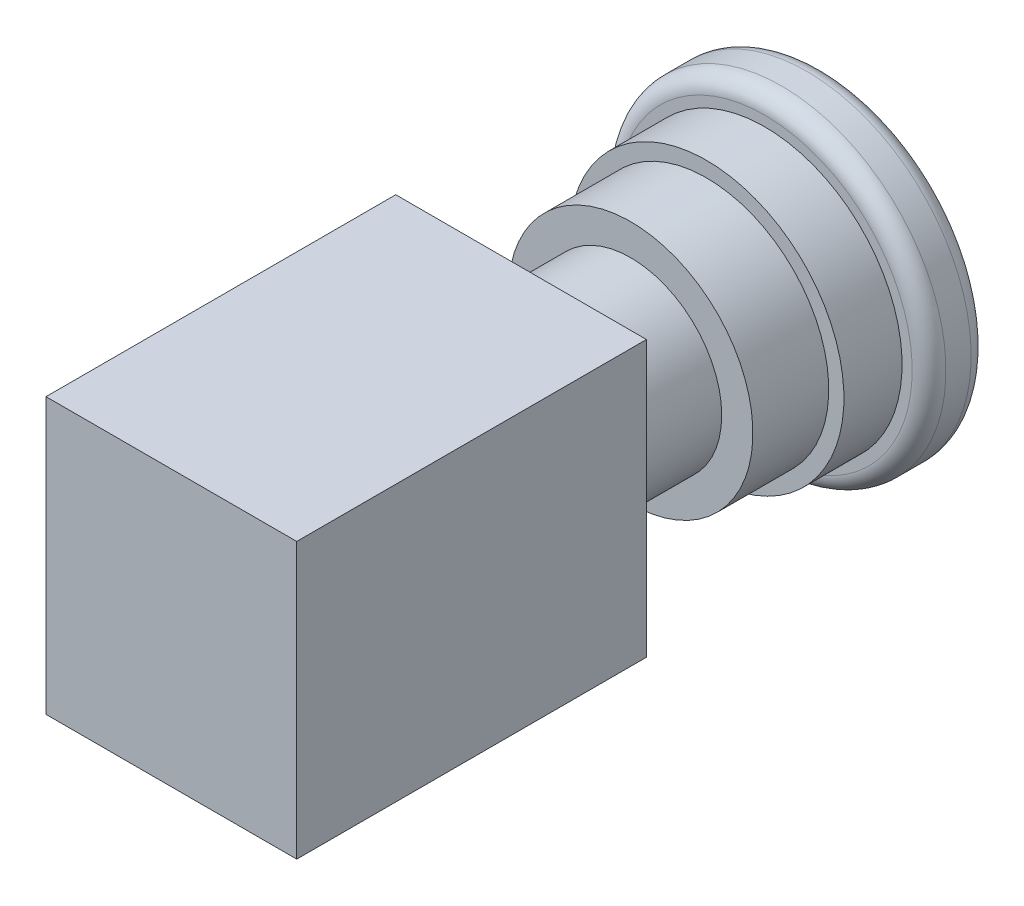
ISO-10303-21;
HEADER;
FILE_DESCRIPTION(('STEP AP214'),'2;1');
FILE_NAME('part.step','',(''),(''),'','','');
FILE_SCHEMA(('AUTOMOTIVE_DESIGN { 1 0 10303 214 1 1 1 1 }'));
ENDSEC;
DATA;
#1=APPLICATION_CONTEXT('core data for automotive mechanical design processes');
#2=APPLICATION_PROTOCOL_DEFINITION('international standard','automotive_design',2000,#1);
#3=PRODUCT_CONTEXT('',#1,'mechanical');
#4=PRODUCT('Part','Part','',(#3));
#5=PRODUCT_RELATED_PRODUCT_CATEGORY('part','',(#4));
#6=PRODUCT_DEFINITION_FORMATION('','',#4);
#7=PRODUCT_DEFINITION_CONTEXT('part definition',#1,'design');
#8=PRODUCT_DEFINITION('design','',#6,#7);
#9=PRODUCT_DEFINITION_SHAPE('','',#8);
#10=(LENGTH_UNIT() NAMED_UNIT(*) SI_UNIT(.MILLI.,.METRE.));
#11=(NAMED_UNIT(*) PLANE_ANGLE_UNIT() SI_UNIT($,.RADIAN.));
#12=(NAMED_UNIT(*) SI_UNIT($,.STERADIAN.) SOLID_ANGLE_UNIT());
#13=UNCERTAINTY_MEASURE_WITH_UNIT(LENGTH_MEASURE(1.E-05),#10,'distance_accuracy_value','');
#14=(GEOMETRIC_REPRESENTATION_CONTEXT(3) GLOBAL_UNCERTAINTY_ASSIGNED_CONTEXT((#13)) GLOBAL_UNIT_ASSIGNED_CONTEXT((#10,
#11,#12)) REPRESENTATION_CONTEXT('',''));
#15=CARTESIAN_POINT('',(0.,0.,0.));
#16=DIRECTION('',(0.,0.,1.));
#17=DIRECTION('',(1.,0.,0.));
#18=AXIS2_PLACEMENT_3D('',#15,#16,#17);
#19=CARTESIAN_POINT('',(0.,0.,13.));
#20=DIRECTION('',(0.,0.,-1.));
#21=DIRECTION('',(-1.,0.,0.));
#22=AXIS2_PLACEMENT_3D('',#19,#20,#21);
#23=CYLINDRICAL_SURFACE('',#22,10.8);
#24=CARTESIAN_POINT('',(0.,0.,13.));
#25=DIRECTION('',(0.,0.,1.));
#26=DIRECTION('',(1.,0.,0.));
#27=AXIS2_PLACEMENT_3D('',#24,#25,#26);
#28=CIRCLE('',#27,10.8);
#29=CARTESIAN_POINT('',(10.8,0.,13.));
#30=VERTEX_POINT('',#29);
#31=EDGE_CURVE('E127',#30,#30,#28,.T.);
#32=ORIENTED_EDGE('',*,*,#31,.F.);
#33=EDGE_LOOP('',(#32));
#34=FACE_BOUND('',#33,.T.);
#35=CARTESIAN_POINT('',(0.,0.,0.));
#36=DIRECTION('',(0.,0.,1.));
#37=DIRECTION('',(1.,0.,0.));
#38=AXIS2_PLACEMENT_3D('',#35,#36,#37);
#39=CIRCLE('',#38,10.8);
#40=CARTESIAN_POINT('',(10.8,0.,0.));
#41=VERTEX_POINT('',#40);
#42=EDGE_CURVE('E124',#41,#41,#39,.T.);
#43=ORIENTED_EDGE('',*,*,#42,.T.);
#44=EDGE_LOOP('',(#43));
#45=FACE_BOUND('',#44,.T.);
#46=ADVANCED_FACE('F37',(#34,#45),#23,.T.);
#47=CARTESIAN_POINT('',(0.,0.,-9.));
#48=DIRECTION('',(0.,0.,1.));
#49=DIRECTION('',(1.,0.,0.));
#50=AXIS2_PLACEMENT_3D('',#47,#48,#49);
#51=CYLINDRICAL_SURFACE('',#50,14.5);
#52=CARTESIAN_POINT('',(0.,0.,-9.));
#53=DIRECTION('',(0.,0.,-1.));
#54=DIRECTION('',(-1.,0.,0.));
#55=AXIS2_PLACEMENT_3D('',#52,#53,#54);
#56=CIRCLE('',#55,14.5);
#57=CARTESIAN_POINT('',(-14.5,0.,-9.));
#58=VERTEX_POINT('',#57);
#59=EDGE_CURVE('E121',#58,#58,#56,.T.);
#60=ORIENTED_EDGE('',*,*,#59,.F.);
#61=EDGE_LOOP('',(#60));
#62=FACE_BOUND('',#61,.T.);
#63=CARTESIAN_POINT('',(0.,0.,0.));
#64=DIRECTION('',(0.,0.,-1.));
#65=DIRECTION('',(-1.,0.,0.));
#66=AXIS2_PLACEMENT_3D('',#63,#64,#65);
#67=CIRCLE('',#66,14.5);
#68=CARTESIAN_POINT('',(-14.5,0.,0.));
#69=VERTEX_POINT('',#68);
#70=EDGE_CURVE('E118',#69,#69,#67,.T.);
#71=ORIENTED_EDGE('',*,*,#70,.T.);
#72=EDGE_LOOP('',(#71));
#73=FACE_BOUND('',#72,.T.);
#74=ADVANCED_FACE('F169',(#62,#73),#51,.T.);
#75=CARTESIAN_POINT('',(0.,0.,0.));
#76=DIRECTION('',(0.,0.,-1.));
#77=DIRECTION('',(-1.,0.,0.));
#78=AXIS2_PLACEMENT_3D('',#75,#76,#77);
#79=PLANE('',#78);
#80=ORIENTED_EDGE('',*,*,#42,.F.);
#81=EDGE_LOOP('',(#80));
#82=FACE_BOUND('',#81,.T.);
#83=ORIENTED_EDGE('',*,*,#70,.F.);
#84=EDGE_LOOP('',(#83));
#85=FACE_BOUND('',#84,.T.);
#86=ADVANCED_FACE('F175',(#82,#85),#79,.F.);
#87=CARTESIAN_POINT('',(0.,0.,-15.9));
#88=DIRECTION('',(0.,0.,1.));
#89=DIRECTION('',(1.,0.,0.));
#90=AXIS2_PLACEMENT_3D('',#87,#88,#89);
#91=CYLINDRICAL_SURFACE('',#90,16.3);
#92=CARTESIAN_POINT('',(0.,0.,-15.9));
#93=DIRECTION('',(0.,0.,-1.));
#94=DIRECTION('',(-1.,0.,0.));
#95=AXIS2_PLACEMENT_3D('',#92,#93,#94);
#96=CIRCLE('',#95,16.3);
#97=CARTESIAN_POINT('',(-16.3,0.,-15.9));
#98=VERTEX_POINT('',#97);
#99=EDGE_CURVE('E115',#98,#98,#96,.T.);
#100=ORIENTED_EDGE('',*,*,#99,.F.);
#101=EDGE_LOOP('',(#100));
#102=FACE_BOUND('',#101,.T.);
#103=CARTESIAN_POINT('',(0.,0.,-9.));
#104=DIRECTION('',(0.,0.,-1.));
#105=DIRECTION('',(-1.,0.,0.));
#106=AXIS2_PLACEMENT_3D('',#103,#104,#105);
#107=CIRCLE('',#106,16.3);
#108=CARTESIAN_POINT('',(-16.3,0.,-9.));
#109=VERTEX_POINT('',#108);
#110=EDGE_CURVE('E114',#109,#109,#107,.T.);
#111=ORIENTED_EDGE('',*,*,#110,.T.);
#112=EDGE_LOOP('',(#111));
#113=FACE_BOUND('',#112,.T.);
#114=ADVANCED_FACE('F183',(#102,#113),#91,.T.);
#115=CARTESIAN_POINT('',(0.,0.,-9.));
#116=DIRECTION('',(0.,0.,-1.));
#117=DIRECTION('',(-1.,0.,0.));
#118=AXIS2_PLACEMENT_3D('',#115,#116,#117);
#119=PLANE('',#118);
#120=ORIENTED_EDGE('',*,*,#59,.T.);
#121=EDGE_LOOP('',(#120));
#122=FACE_BOUND('',#121,.T.);
#123=ORIENTED_EDGE('',*,*,#110,.F.);
#124=EDGE_LOOP('',(#123));
#125=FACE_BOUND('',#124,.T.);
#126=ADVANCED_FACE('F152',(#122,#125),#119,.F.);
#127=CARTESIAN_POINT('',(0.,0.,-22.9));
#128=DIRECTION('',(0.,0.,1.));
#129=DIRECTION('',(1.,0.,0.));
#130=AXIS2_PLACEMENT_3D('',#127,#128,#129);
#131=CYLINDRICAL_SURFACE('',#130,19.5);
#132=CARTESIAN_POINT('',(0.,0.,-17.9));
#133=DIRECTION('',(0.,0.,-1.));
#134=DIRECTION('',(-1.,0.,0.));
#135=AXIS2_PLACEMENT_3D('',#132,#133,#134);
#136=CIRCLE('',#135,19.5);
#137=CARTESIAN_POINT('',(-19.5,0.,-17.9));
#138=VERTEX_POINT('',#137);
#139=EDGE_CURVE('E135',#138,#138,#136,.T.);
#140=ORIENTED_EDGE('',*,*,#139,.T.);
#141=EDGE_LOOP('',(#140));
#142=FACE_BOUND('',#141,.T.);
#143=CARTESIAN_POINT('',(0.,0.,-20.9));
#144=DIRECTION('',(0.,0.,-1.));
#145=DIRECTION('',(-1.,0.,0.));
#146=AXIS2_PLACEMENT_3D('',#143,#144,#145);
#147=CIRCLE('',#146,19.5);
#148=CARTESIAN_POINT('',(-19.5,0.,-20.9));
#149=VERTEX_POINT('',#148);
#150=EDGE_CURVE('E130',#149,#149,#147,.F.);
#151=ORIENTED_EDGE('',*,*,#150,.T.);
#152=EDGE_LOOP('',(#151));
#153=FACE_BOUND('',#152,.T.);
#154=ADVANCED_FACE('F148',(#142,#153),#131,.T.);
#155=CARTESIAN_POINT('',(0.,0.,-22.9));
#156=DIRECTION('',(0.,0.,-1.));
#157=DIRECTION('',(-1.,0.,0.));
#158=AXIS2_PLACEMENT_3D('',#155,#156,#157);
#159=PLANE('',#158);
#160=CARTESIAN_POINT('',(0.,0.,-22.9));
#161=DIRECTION('',(0.,0.,-1.));
#162=DIRECTION('',(-1.,0.,0.));
#163=AXIS2_PLACEMENT_3D('',#160,#161,#162);
#164=CIRCLE('',#163,17.5);
#165=CARTESIAN_POINT('',(-17.5,0.,-22.9));
#166=VERTEX_POINT('',#165);
#167=EDGE_CURVE('E11',#166,#166,#164,.T.);
#168=ORIENTED_EDGE('',*,*,#167,.T.);
#169=EDGE_LOOP('',(#168));
#170=FACE_BOUND('',#169,.T.);
#171=ADVANCED_FACE('F151',(#170),#159,.T.);
#172=CARTESIAN_POINT('',(0.,0.,-15.9));
#173=DIRECTION('',(0.,0.,-1.));
#174=DIRECTION('',(-1.,0.,0.));
#175=AXIS2_PLACEMENT_3D('',#172,#173,#174);
#176=PLANE('',#175);
#177=CARTESIAN_POINT('',(0.,0.,-15.9));
#178=DIRECTION('',(0.,0.,-1.));
#179=DIRECTION('',(-1.,0.,0.));
#180=AXIS2_PLACEMENT_3D('',#177,#178,#179);
#181=CIRCLE('',#180,17.5);
#182=CARTESIAN_POINT('',(-17.5,0.,-15.9));
#183=VERTEX_POINT('',#182);
#184=EDGE_CURVE('E46',#183,#183,#181,.F.);
#185=ORIENTED_EDGE('',*,*,#184,.T.);
#186=EDGE_LOOP('',(#185));
#187=FACE_BOUND('',#186,.T.);
#188=ORIENTED_EDGE('',*,*,#99,.T.);
#189=EDGE_LOOP('',(#188));
#190=FACE_BOUND('',#189,.T.);
#191=ADVANCED_FACE('F140',(#187,#190),#176,.F.);
#192=CARTESIAN_POINT('',(0.,0.,-17.9));
#193=DIRECTION('',(0.,0.,-1.));
#194=DIRECTION('',(-1.,0.,0.));
#195=AXIS2_PLACEMENT_3D('',#192,#193,#194);
#196=TOROIDAL_SURFACE('',#195,17.5,2.);
#197=ORIENTED_EDGE('',*,*,#184,.F.);
#198=EDGE_LOOP('',(#197));
#199=FACE_BOUND('',#198,.T.);
#200=ORIENTED_EDGE('',*,*,#139,.F.);
#201=EDGE_LOOP('',(#200));
#202=FACE_BOUND('',#201,.T.);
#203=ADVANCED_FACE('F143',(#199,#202),#196,.T.);
#204=CARTESIAN_POINT('',(0.,0.,-20.9));
#205=DIRECTION('',(0.,0.,-1.));
#206=DIRECTION('',(-1.,0.,0.));
#207=AXIS2_PLACEMENT_3D('',#204,#205,#206);
#208=TOROIDAL_SURFACE('',#207,17.5,2.);
#209=ORIENTED_EDGE('',*,*,#150,.F.);
#210=EDGE_LOOP('',(#209));
#211=FACE_BOUND('',#210,.T.);
#212=ORIENTED_EDGE('',*,*,#167,.F.);
#213=EDGE_LOOP('',(#212));
#214=FACE_BOUND('',#213,.T.);
#215=ADVANCED_FACE('F39',(#211,#214),#208,.T.);
#216=CARTESIAN_POINT('',(14.875,-16.325,54.5));
#217=DIRECTION('',(-1.,0.,0.));
#218=DIRECTION('',(0.,0.,1.));
#219=AXIS2_PLACEMENT_3D('',#216,#217,#218);
#220=PLANE('',#219);
#221=DIRECTION('',(0.,1.,0.));
#222=VECTOR('',#221,1.);
#223=CARTESIAN_POINT('',(14.875,-16.325,13.));
#224=LINE('',#223,#222);
#225=CARTESIAN_POINT('',(14.875,-16.325,13.));
#226=VERTEX_POINT('',#225);
#227=CARTESIAN_POINT('',(14.875,16.325,13.));
#228=VERTEX_POINT('',#227);
#229=EDGE_CURVE('E105',#226,#228,#224,.T.);
#230=ORIENTED_EDGE('',*,*,#229,.T.);
#231=DIRECTION('',(0.,0.,-1.));
#232=VECTOR('',#231,1.);
#233=CARTESIAN_POINT('',(14.875,16.325,54.5));
#234=LINE('',#233,#232);
#235=CARTESIAN_POINT('',(14.875,16.325,54.5));
#236=VERTEX_POINT('',#235);
#237=EDGE_CURVE('E96',#236,#228,#234,.T.);
#238=ORIENTED_EDGE('',*,*,#237,.F.);
#239=DIRECTION('',(0.,1.,0.));
#240=VECTOR('',#239,1.);
#241=CARTESIAN_POINT('',(14.875,-16.325,54.5));
#242=LINE('',#241,#240);
#243=CARTESIAN_POINT('',(14.875,-16.325,54.5));
#244=VERTEX_POINT('',#243);
#245=EDGE_CURVE('E90',#244,#236,#242,.T.);
#246=ORIENTED_EDGE('',*,*,#245,.F.);
#247=DIRECTION('',(0.,0.,-1.));
#248=VECTOR('',#247,1.);
#249=CARTESIAN_POINT('',(14.875,-16.325,54.5));
#250=LINE('',#249,#248);
#251=EDGE_CURVE('E101',#244,#226,#250,.T.);
#252=ORIENTED_EDGE('',*,*,#251,.T.);
#253=EDGE_LOOP('',(#230,#238,#246,#252));
#254=FACE_BOUND('',#253,.T.);
#255=ADVANCED_FACE('F158',(#254),#220,.F.);
#256=CARTESIAN_POINT('',(-14.875,16.325,54.5));
#257=DIRECTION('',(0.,-1.,0.));
#258=DIRECTION('',(0.,0.,-1.));
#259=AXIS2_PLACEMENT_3D('',#256,#257,#258);
#260=PLANE('',#259);
#261=DIRECTION('',(-1.,0.,0.));
#262=VECTOR('',#261,1.);
#263=CARTESIAN_POINT('',(-14.875,16.325,13.));
#264=LINE('',#263,#262);
#265=CARTESIAN_POINT('',(-14.875,16.325,13.));
#266=VERTEX_POINT('',#265);
#267=EDGE_CURVE('E95',#228,#266,#264,.T.);
#268=ORIENTED_EDGE('',*,*,#267,.T.);
#269=DIRECTION('',(0.,0.,-1.));
#270=VECTOR('',#269,1.);
#271=CARTESIAN_POINT('',(-14.875,16.325,54.5));
#272=LINE('',#271,#270);
#273=CARTESIAN_POINT('',(-14.875,16.325,54.5));
#274=VERTEX_POINT('',#273);
#275=EDGE_CURVE('E93',#274,#266,#272,.T.);
#276=ORIENTED_EDGE('',*,*,#275,.F.);
#277=DIRECTION('',(-1.,0.,0.));
#278=VECTOR('',#277,1.);
#279=CARTESIAN_POINT('',(-14.875,16.325,54.5));
#280=LINE('',#279,#278);
#281=EDGE_CURVE('E85',#236,#274,#280,.T.);
#282=ORIENTED_EDGE('',*,*,#281,.F.);
#283=ORIENTED_EDGE('',*,*,#237,.T.);
#284=EDGE_LOOP('',(#268,#276,#282,#283));
#285=FACE_BOUND('',#284,.T.);
#286=ADVANCED_FACE('F94',(#285),#260,.F.);
#287=CARTESIAN_POINT('',(-14.875,-16.325,54.5));
#288=DIRECTION('',(1.,0.,0.));
#289=DIRECTION('',(0.,0.,-1.));
#290=AXIS2_PLACEMENT_3D('',#287,#288,#289);
#291=PLANE('',#290);
#292=DIRECTION('',(0.,-1.,0.));
#293=VECTOR('',#292,1.);
#294=CARTESIAN_POINT('',(-14.875,-16.325,13.));
#295=LINE('',#294,#293);
#296=CARTESIAN_POINT('',(-14.875,-16.325,13.));
#297=VERTEX_POINT('',#296);
#298=EDGE_CURVE('E71',#266,#297,#295,.T.);
#299=ORIENTED_EDGE('',*,*,#298,.T.);
#300=DIRECTION('',(0.,0.,-1.));
#301=VECTOR('',#300,1.);
#302=CARTESIAN_POINT('',(-14.875,-16.325,54.5));
#303=LINE('',#302,#301);
#304=CARTESIAN_POINT('',(-14.875,-16.325,54.5));
#305=VERTEX_POINT('',#304);
#306=EDGE_CURVE('E97',#305,#297,#303,.T.);
#307=ORIENTED_EDGE('',*,*,#306,.F.);
#308=DIRECTION('',(0.,-1.,0.));
#309=VECTOR('',#308,1.);
#310=CARTESIAN_POINT('',(-14.875,-16.325,54.5));
#311=LINE('',#310,#309);
#312=EDGE_CURVE('E88',#274,#305,#311,.T.);
#313=ORIENTED_EDGE('',*,*,#312,.F.);
#314=ORIENTED_EDGE('',*,*,#275,.T.);
#315=EDGE_LOOP('',(#299,#307,#313,#314));
#316=FACE_BOUND('',#315,.T.);
#317=ADVANCED_FACE('F99',(#316),#291,.F.);
#318=CARTESIAN_POINT('',(-14.875,-16.325,54.5));
#319=DIRECTION('',(0.,1.,0.));
#320=DIRECTION('',(0.,0.,1.));
#321=AXIS2_PLACEMENT_3D('',#318,#319,#320);
#322=PLANE('',#321);
#323=DIRECTION('',(1.,0.,0.));
#324=VECTOR('',#323,1.);
#325=CARTESIAN_POINT('',(-14.875,-16.325,13.));
#326=LINE('',#325,#324);
#327=EDGE_CURVE('E77',#297,#226,#326,.T.);
#328=ORIENTED_EDGE('',*,*,#327,.T.);
#329=ORIENTED_EDGE('',*,*,#251,.F.);
#330=DIRECTION('',(1.,0.,0.));
#331=VECTOR('',#330,1.);
#332=CARTESIAN_POINT('',(-14.875,-16.325,54.5));
#333=LINE('',#332,#331);
#334=EDGE_CURVE('E54',#305,#244,#333,.T.);
#335=ORIENTED_EDGE('',*,*,#334,.F.);
#336=ORIENTED_EDGE('',*,*,#306,.T.);
#337=EDGE_LOOP('',(#328,#329,#335,#336));
#338=FACE_BOUND('',#337,.T.);
#339=ADVANCED_FACE('F252',(#338),#322,.F.);
#340=CARTESIAN_POINT('',(0.,0.,54.5));
#341=DIRECTION('',(0.,0.,-1.));
#342=DIRECTION('',(-1.,0.,0.));
#343=AXIS2_PLACEMENT_3D('',#340,#341,#342);
#344=PLANE('',#343);
#345=ORIENTED_EDGE('',*,*,#245,.T.);
#346=ORIENTED_EDGE('',*,*,#281,.T.);
#347=ORIENTED_EDGE('',*,*,#312,.T.);
#348=ORIENTED_EDGE('',*,*,#334,.T.);
#349=EDGE_LOOP('',(#345,#346,#347,#348));
#350=FACE_BOUND('',#349,.T.);
#351=ADVANCED_FACE('F86',(#350),#344,.F.);
#352=CARTESIAN_POINT('',(0.,0.,13.));
#353=DIRECTION('',(0.,0.,-1.));
#354=DIRECTION('',(-1.,0.,0.));
#355=AXIS2_PLACEMENT_3D('',#352,#353,#354);
#356=PLANE('',#355);
#357=ORIENTED_EDGE('',*,*,#31,.T.);
#358=EDGE_LOOP('',(#357));
#359=FACE_BOUND('',#358,.T.);
#360=ORIENTED_EDGE('',*,*,#229,.F.);
#361=ORIENTED_EDGE('',*,*,#327,.F.);
#362=ORIENTED_EDGE('',*,*,#298,.F.);
#363=ORIENTED_EDGE('',*,*,#267,.F.);
#364=EDGE_LOOP('',(#360,#361,#362,#363));
#365=FACE_BOUND('',#364,.T.);
#366=ADVANCED_FACE('F269',(#359,#365),#356,.T.);
#367=CLOSED_SHELL('',(#46,#74,#86,#114,#126,#154,#171,#191,#203,#215,#255,#286,#317,#339,#351,#366));
#368=MANIFOLD_SOLID_BREP('B2',#367);
#369=ADVANCED_BREP_SHAPE_REPRESENTATION('',(#18,#368),#14);
#370=SHAPE_DEFINITION_REPRESENTATION(#9,#369);
ENDSEC;
END-ISO-10303-21;
